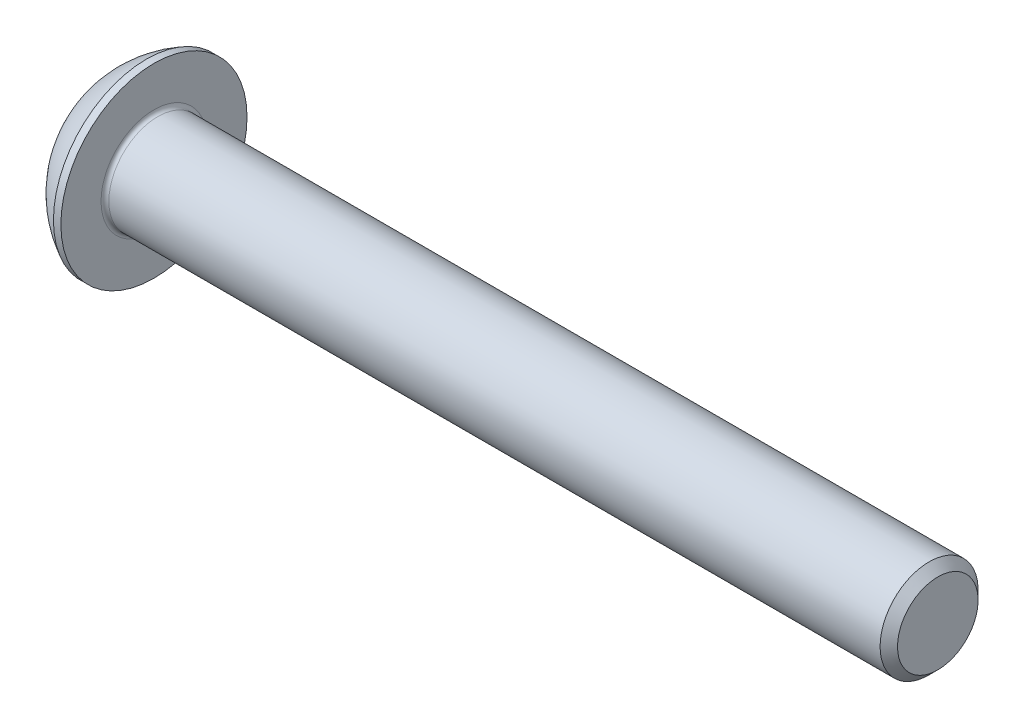
ISO-10303-21;
HEADER;
FILE_DESCRIPTION(('STEP AP214'),'2;1');
FILE_NAME('part.step','',(''),(''),'','','');
FILE_SCHEMA(('AUTOMOTIVE_DESIGN { 1 0 10303 214 1 1 1 1 }'));
ENDSEC;
DATA;
#1=APPLICATION_CONTEXT('core data for automotive mechanical design processes');
#2=APPLICATION_PROTOCOL_DEFINITION('international standard','automotive_design',2000,#1);
#3=PRODUCT_CONTEXT('',#1,'mechanical');
#4=PRODUCT('Part','Part','',(#3));
#5=PRODUCT_RELATED_PRODUCT_CATEGORY('part','',(#4));
#6=PRODUCT_DEFINITION_FORMATION('','',#4);
#7=PRODUCT_DEFINITION_CONTEXT('part definition',#1,'design');
#8=PRODUCT_DEFINITION('design','',#6,#7);
#9=PRODUCT_DEFINITION_SHAPE('','',#8);
#10=(LENGTH_UNIT() NAMED_UNIT(*) SI_UNIT(.MILLI.,.METRE.));
#11=(NAMED_UNIT(*) PLANE_ANGLE_UNIT() SI_UNIT($,.RADIAN.));
#12=(NAMED_UNIT(*) SI_UNIT($,.STERADIAN.) SOLID_ANGLE_UNIT());
#13=UNCERTAINTY_MEASURE_WITH_UNIT(LENGTH_MEASURE(1.E-05),#10,'distance_accuracy_value','');
#14=(GEOMETRIC_REPRESENTATION_CONTEXT(3) GLOBAL_UNCERTAINTY_ASSIGNED_CONTEXT((#13)) GLOBAL_UNIT_ASSIGNED_CONTEXT((#10,
#11,#12)) REPRESENTATION_CONTEXT('',''));
#15=CARTESIAN_POINT('',(0.,0.,0.));
#16=DIRECTION('',(0.,0.,1.));
#17=DIRECTION('',(1.,0.,0.));
#18=AXIS2_PLACEMENT_3D('',#15,#16,#17);
#19=CARTESIAN_POINT('',(0.,0.,0.));
#20=DIRECTION('',(-1.,0.,0.));
#21=DIRECTION('',(0.,0.,1.));
#22=AXIS2_PLACEMENT_3D('',#19,#20,#21);
#23=PLANE('',#22);
#24=CARTESIAN_POINT('',(0.,0.,0.));
#25=DIRECTION('',(-1.,0.,0.));
#26=DIRECTION('',(0.,0.,1.));
#27=AXIS2_PLACEMENT_3D('',#24,#25,#26);
#28=CIRCLE('',#27,2.375);
#29=CARTESIAN_POINT('',(0.,0.,2.375));
#30=VERTEX_POINT('',#29);
#31=EDGE_CURVE('E163',#30,#30,#28,.T.);
#32=ORIENTED_EDGE('',*,*,#31,.T.);
#33=EDGE_LOOP('',(#32));
#34=FACE_BOUND('',#33,.T.);
#35=DIRECTION('',(0.,-1.,0.));
#36=VECTOR('',#35,1.);
#37=CARTESIAN_POINT('',(0.,-0.866025403784438,1.5));
#38=LINE('',#37,#36);
#39=CARTESIAN_POINT('',(0.,0.866025403784439,1.5));
#40=VERTEX_POINT('',#39);
#41=CARTESIAN_POINT('',(0.,-0.866025403784438,1.5));
#42=VERTEX_POINT('',#41);
#43=EDGE_CURVE('E53',#40,#42,#38,.T.);
#44=ORIENTED_EDGE('',*,*,#43,.T.);
#45=DIRECTION('',(0.,-0.5,-0.866025403784439));
#46=VECTOR('',#45,1.);
#47=CARTESIAN_POINT('',(0.,-1.73205080756888,0.));
#48=LINE('',#47,#46);
#49=CARTESIAN_POINT('',(0.,-1.73205080756888,0.));
#50=VERTEX_POINT('',#49);
#51=EDGE_CURVE('E256',#42,#50,#48,.T.);
#52=ORIENTED_EDGE('',*,*,#51,.T.);
#53=DIRECTION('',(0.,0.5,-0.866025403784439));
#54=VECTOR('',#53,1.);
#55=CARTESIAN_POINT('',(0.,-0.866025403784438,-1.5));
#56=LINE('',#55,#54);
#57=CARTESIAN_POINT('',(0.,-0.866025403784438,-1.5));
#58=VERTEX_POINT('',#57);
#59=EDGE_CURVE('E138',#50,#58,#56,.T.);
#60=ORIENTED_EDGE('',*,*,#59,.T.);
#61=DIRECTION('',(0.,1.,0.));
#62=VECTOR('',#61,1.);
#63=CARTESIAN_POINT('',(0.,0.866025403784439,-1.5));
#64=LINE('',#63,#62);
#65=CARTESIAN_POINT('',(0.,0.866025403784439,-1.5));
#66=VERTEX_POINT('',#65);
#67=EDGE_CURVE('E259',#58,#66,#64,.T.);
#68=ORIENTED_EDGE('',*,*,#67,.T.);
#69=DIRECTION('',(0.,0.5,0.866025403784439));
#70=VECTOR('',#69,1.);
#71=CARTESIAN_POINT('',(0.,1.73205080756888,0.));
#72=LINE('',#71,#70);
#73=CARTESIAN_POINT('',(0.,1.73205080756888,0.));
#74=VERTEX_POINT('',#73);
#75=EDGE_CURVE('E261',#66,#74,#72,.T.);
#76=ORIENTED_EDGE('',*,*,#75,.T.);
#77=DIRECTION('',(0.,-0.5,0.866025403784439));
#78=VECTOR('',#77,1.);
#79=CARTESIAN_POINT('',(0.,0.866025403784439,1.5));
#80=LINE('',#79,#78);
#81=EDGE_CURVE('E263',#74,#40,#80,.T.);
#82=ORIENTED_EDGE('',*,*,#81,.T.);
#83=EDGE_LOOP('',(#44,#52,#60,#68,#76,#82));
#84=FACE_BOUND('',#83,.T.);
#85=ADVANCED_FACE('F38',(#34,#84),#23,.T.);
#86=CARTESIAN_POINT('',(4.75501582278481,0.,0.));
#87=DIRECTION('',(-1.,0.,0.));
#88=DIRECTION('',(0.,1.,0.));
#89=AXIS2_PLACEMENT_3D('',#86,#87,#88);
#90=SPHERICAL_SURFACE('',#89,5.3151482081814);
#91=CARTESIAN_POINT('',(2.37,0.,0.));
#92=DIRECTION('',(-1.,0.,0.));
#93=DIRECTION('',(0.,0.,1.));
#94=AXIS2_PLACEMENT_3D('',#91,#92,#93);
#95=CIRCLE('',#94,4.75);
#96=CARTESIAN_POINT('',(2.37,0.,4.75));
#97=VERTEX_POINT('',#96);
#98=EDGE_CURVE('E160',#97,#97,#95,.T.);
#99=ORIENTED_EDGE('',*,*,#98,.T.);
#100=EDGE_LOOP('',(#99));
#101=FACE_BOUND('',#100,.T.);
#102=ORIENTED_EDGE('',*,*,#31,.F.);
#103=EDGE_LOOP('',(#102));
#104=FACE_BOUND('',#103,.T.);
#105=ADVANCED_FACE('F184',(#101,#104),#90,.T.);
#106=CARTESIAN_POINT('',(0.,0.,0.));
#107=DIRECTION('',(-1.,0.,0.));
#108=DIRECTION('',(0.,0.,1.));
#109=AXIS2_PLACEMENT_3D('',#106,#107,#108);
#110=CYLINDRICAL_SURFACE('',#109,4.75);
#111=ORIENTED_EDGE('',*,*,#98,.F.);
#112=EDGE_LOOP('',(#111));
#113=FACE_BOUND('',#112,.T.);
#114=CARTESIAN_POINT('',(2.75,0.,0.));
#115=DIRECTION('',(-1.,0.,0.));
#116=DIRECTION('',(0.,0.,1.));
#117=AXIS2_PLACEMENT_3D('',#114,#115,#116);
#118=CIRCLE('',#117,4.75);
#119=CARTESIAN_POINT('',(2.75,0.,4.75));
#120=VERTEX_POINT('',#119);
#121=EDGE_CURVE('E157',#120,#120,#118,.T.);
#122=ORIENTED_EDGE('',*,*,#121,.T.);
#123=EDGE_LOOP('',(#122));
#124=FACE_BOUND('',#123,.T.);
#125=ADVANCED_FACE('F189',(#113,#124),#110,.T.);
#126=CARTESIAN_POINT('',(2.75,2.5,0.));
#127=DIRECTION('',(-1.,0.,0.));
#128=DIRECTION('',(0.,0.,1.));
#129=AXIS2_PLACEMENT_3D('',#126,#127,#128);
#130=PLANE('',#129);
#131=CARTESIAN_POINT('',(2.75,0.,0.));
#132=DIRECTION('',(-1.,0.,0.));
#133=DIRECTION('',(0.,0.,1.));
#134=AXIS2_PLACEMENT_3D('',#131,#132,#133);
#135=CIRCLE('',#134,2.7);
#136=CARTESIAN_POINT('',(2.75,0.,2.7));
#137=VERTEX_POINT('',#136);
#138=EDGE_CURVE('E46',#137,#137,#135,.T.);
#139=ORIENTED_EDGE('',*,*,#138,.T.);
#140=EDGE_LOOP('',(#139));
#141=FACE_BOUND('',#140,.T.);
#142=ORIENTED_EDGE('',*,*,#121,.F.);
#143=EDGE_LOOP('',(#142));
#144=FACE_BOUND('',#143,.T.);
#145=ADVANCED_FACE('F168',(#141,#144),#130,.F.);
#146=CARTESIAN_POINT('',(0.,0.,0.));
#147=DIRECTION('',(-1.,0.,0.));
#148=DIRECTION('',(0.,0.,1.));
#149=AXIS2_PLACEMENT_3D('',#146,#147,#148);
#150=CYLINDRICAL_SURFACE('',#149,2.5);
#151=CARTESIAN_POINT('',(2.95,0.,0.));
#152=DIRECTION('',(-1.,0.,0.));
#153=DIRECTION('',(0.,0.,1.));
#154=AXIS2_PLACEMENT_3D('',#151,#152,#153);
#155=CIRCLE('',#154,2.5);
#156=CARTESIAN_POINT('',(2.95,0.,2.5));
#157=VERTEX_POINT('',#156);
#158=EDGE_CURVE('E11',#157,#157,#155,.F.);
#159=ORIENTED_EDGE('',*,*,#158,.T.);
#160=EDGE_LOOP('',(#159));
#161=FACE_BOUND('',#160,.T.);
#162=CARTESIAN_POINT('',(42.305,0.,0.));
#163=DIRECTION('',(-1.,0.,0.));
#164=DIRECTION('',(0.,0.,1.));
#165=AXIS2_PLACEMENT_3D('',#162,#163,#164);
#166=CIRCLE('',#165,2.5);
#167=CARTESIAN_POINT('',(42.305,0.,2.5));
#168=VERTEX_POINT('',#167);
#169=EDGE_CURVE('E154',#168,#168,#166,.T.);
#170=ORIENTED_EDGE('',*,*,#169,.T.);
#171=EDGE_LOOP('',(#170));
#172=FACE_BOUND('',#171,.T.);
#173=ADVANCED_FACE('F198',(#161,#172),#150,.T.);
#174=CARTESIAN_POINT('',(42.75,0.,0.));
#175=DIRECTION('',(-1.,0.,0.));
#176=DIRECTION('',(0.,0.,1.));
#177=AXIS2_PLACEMENT_3D('',#174,#175,#176);
#178=CONICAL_SURFACE('',#177,2.055,0.785398163397426);
#179=ORIENTED_EDGE('',*,*,#169,.F.);
#180=EDGE_LOOP('',(#179));
#181=FACE_BOUND('',#180,.T.);
#182=CARTESIAN_POINT('',(42.75,0.,0.));
#183=DIRECTION('',(-1.,0.,0.));
#184=DIRECTION('',(0.,0.,1.));
#185=AXIS2_PLACEMENT_3D('',#182,#183,#184);
#186=CIRCLE('',#185,2.055);
#187=CARTESIAN_POINT('',(42.75,0.,2.055));
#188=VERTEX_POINT('',#187);
#189=EDGE_CURVE('E150',#188,#188,#186,.T.);
#190=ORIENTED_EDGE('',*,*,#189,.T.);
#191=EDGE_LOOP('',(#190));
#192=FACE_BOUND('',#191,.T.);
#193=ADVANCED_FACE('F179',(#181,#192),#178,.T.);
#194=CARTESIAN_POINT('',(42.75,0.,0.));
#195=DIRECTION('',(-1.,0.,0.));
#196=DIRECTION('',(0.,0.,1.));
#197=AXIS2_PLACEMENT_3D('',#194,#195,#196);
#198=PLANE('',#197);
#199=ORIENTED_EDGE('',*,*,#189,.F.);
#200=EDGE_LOOP('',(#199));
#201=FACE_BOUND('',#200,.T.);
#202=ADVANCED_FACE('F172',(#201),#198,.F.);
#203=CARTESIAN_POINT('',(2.95,0.,0.));
#204=DIRECTION('',(-1.,0.,0.));
#205=DIRECTION('',(0.,0.,1.));
#206=AXIS2_PLACEMENT_3D('',#203,#204,#205);
#207=TOROIDAL_SURFACE('',#206,2.7,0.2);
#208=ORIENTED_EDGE('',*,*,#158,.F.);
#209=EDGE_LOOP('',(#208));
#210=FACE_BOUND('',#209,.T.);
#211=ORIENTED_EDGE('',*,*,#138,.F.);
#212=EDGE_LOOP('',(#211));
#213=FACE_BOUND('',#212,.T.);
#214=ADVANCED_FACE('F40',(#210,#213),#207,.F.);
#215=CARTESIAN_POINT('',(1.56,-1.73205080756888,0.));
#216=DIRECTION('',(0.,0.866025403784439,-0.5));
#217=DIRECTION('',(0.,0.5,0.866025403784439));
#218=AXIS2_PLACEMENT_3D('',#215,#216,#217);
#219=PLANE('',#218);
#220=DIRECTION('',(0.,-0.5,-0.866025403784439));
#221=VECTOR('',#220,1.);
#222=CARTESIAN_POINT('',(1.56,-1.73205080756888,0.));
#223=LINE('',#222,#221);
#224=CARTESIAN_POINT('',(1.56,-0.866025403784438,1.5));
#225=VERTEX_POINT('',#224);
#226=CARTESIAN_POINT('',(1.56,-1.29903810567666,0.749999999999999));
#227=VERTEX_POINT('',#226);
#228=EDGE_CURVE('E121',#225,#227,#223,.T.);
#229=ORIENTED_EDGE('',*,*,#228,.T.);
#230=CARTESIAN_POINT('',(1.56,-1.73205080756888,0.));
#231=VERTEX_POINT('',#230);
#232=EDGE_CURVE('E114',#227,#231,#223,.T.);
#233=ORIENTED_EDGE('',*,*,#232,.T.);
#234=DIRECTION('',(-1.,0.,0.));
#235=VECTOR('',#234,1.);
#236=CARTESIAN_POINT('',(1.56,-1.73205080756888,0.));
#237=LINE('',#236,#235);
#238=EDGE_CURVE('E118',#231,#50,#237,.T.);
#239=ORIENTED_EDGE('',*,*,#238,.T.);
#240=ORIENTED_EDGE('',*,*,#51,.F.);
#241=DIRECTION('',(-1.,0.,0.));
#242=VECTOR('',#241,1.);
#243=CARTESIAN_POINT('',(1.56,-0.866025403784438,1.5));
#244=LINE('',#243,#242);
#245=EDGE_CURVE('E246',#225,#42,#244,.T.);
#246=ORIENTED_EDGE('',*,*,#245,.F.);
#247=EDGE_LOOP('',(#229,#233,#239,#240,#246));
#248=FACE_BOUND('',#247,.T.);
#249=ADVANCED_FACE('F116',(#248),#219,.T.);
#250=CARTESIAN_POINT('',(1.56,-0.866025403784438,-1.5));
#251=DIRECTION('',(0.,0.866025403784439,0.5));
#252=DIRECTION('',(0.,-0.5,0.866025403784439));
#253=AXIS2_PLACEMENT_3D('',#250,#251,#252);
#254=PLANE('',#253);
#255=DIRECTION('',(0.,0.5,-0.866025403784439));
#256=VECTOR('',#255,1.);
#257=CARTESIAN_POINT('',(1.56,-0.866025403784438,-1.5));
#258=LINE('',#257,#256);
#259=CARTESIAN_POINT('',(1.56,-1.29903810567666,-0.749999999999999));
#260=VERTEX_POINT('',#259);
#261=EDGE_CURVE('E126',#231,#260,#258,.T.);
#262=ORIENTED_EDGE('',*,*,#261,.T.);
#263=CARTESIAN_POINT('',(1.56,-0.866025403784438,-1.5));
#264=VERTEX_POINT('',#263);
#265=EDGE_CURVE('E133',#260,#264,#258,.T.);
#266=ORIENTED_EDGE('',*,*,#265,.T.);
#267=DIRECTION('',(-1.,0.,0.));
#268=VECTOR('',#267,1.);
#269=CARTESIAN_POINT('',(1.56,-0.866025403784438,-1.5));
#270=LINE('',#269,#268);
#271=EDGE_CURVE('E140',#264,#58,#270,.T.);
#272=ORIENTED_EDGE('',*,*,#271,.T.);
#273=ORIENTED_EDGE('',*,*,#59,.F.);
#274=ORIENTED_EDGE('',*,*,#238,.F.);
#275=EDGE_LOOP('',(#262,#266,#272,#273,#274));
#276=FACE_BOUND('',#275,.T.);
#277=ADVANCED_FACE('F136',(#276),#254,.T.);
#278=CARTESIAN_POINT('',(1.56,0.866025403784439,-1.5));
#279=DIRECTION('',(0.,0.,1.));
#280=DIRECTION('',(1.,0.,0.));
#281=AXIS2_PLACEMENT_3D('',#278,#279,#280);
#282=PLANE('',#281);
#283=DIRECTION('',(0.,1.,0.));
#284=VECTOR('',#283,1.);
#285=CARTESIAN_POINT('',(1.56,0.866025403784439,-1.5));
#286=LINE('',#285,#284);
#287=CARTESIAN_POINT('',(1.56,0.,-1.5));
#288=VERTEX_POINT('',#287);
#289=EDGE_CURVE('E282',#264,#288,#286,.T.);
#290=ORIENTED_EDGE('',*,*,#289,.T.);
#291=CARTESIAN_POINT('',(1.56,0.866025403784439,-1.5));
#292=VERTEX_POINT('',#291);
#293=EDGE_CURVE('E132',#288,#292,#286,.T.);
#294=ORIENTED_EDGE('',*,*,#293,.T.);
#295=DIRECTION('',(-1.,0.,0.));
#296=VECTOR('',#295,1.);
#297=CARTESIAN_POINT('',(1.56,0.866025403784439,-1.5));
#298=LINE('',#297,#296);
#299=EDGE_CURVE('E145',#292,#66,#298,.T.);
#300=ORIENTED_EDGE('',*,*,#299,.T.);
#301=ORIENTED_EDGE('',*,*,#67,.F.);
#302=ORIENTED_EDGE('',*,*,#271,.F.);
#303=EDGE_LOOP('',(#290,#294,#300,#301,#302));
#304=FACE_BOUND('',#303,.T.);
#305=ADVANCED_FACE('F212',(#304),#282,.T.);
#306=CARTESIAN_POINT('',(1.56,1.73205080756888,0.));
#307=DIRECTION('',(0.,-0.866025403784438,0.5));
#308=DIRECTION('',(0.,-0.5,-0.866025403784439));
#309=AXIS2_PLACEMENT_3D('',#306,#307,#308);
#310=PLANE('',#309);
#311=DIRECTION('',(0.,0.5,0.866025403784439));
#312=VECTOR('',#311,1.);
#313=CARTESIAN_POINT('',(1.56,1.73205080756888,0.));
#314=LINE('',#313,#312);
#315=CARTESIAN_POINT('',(1.56,1.29903810567666,-0.750000000000001));
#316=VERTEX_POINT('',#315);
#317=EDGE_CURVE('E288',#292,#316,#314,.T.);
#318=ORIENTED_EDGE('',*,*,#317,.T.);
#319=CARTESIAN_POINT('',(1.56,1.73205080756888,0.));
#320=VERTEX_POINT('',#319);
#321=EDGE_CURVE('E286',#316,#320,#314,.T.);
#322=ORIENTED_EDGE('',*,*,#321,.T.);
#323=DIRECTION('',(-1.,0.,0.));
#324=VECTOR('',#323,1.);
#325=CARTESIAN_POINT('',(1.56,1.73205080756888,0.));
#326=LINE('',#325,#324);
#327=EDGE_CURVE('E268',#320,#74,#326,.T.);
#328=ORIENTED_EDGE('',*,*,#327,.T.);
#329=ORIENTED_EDGE('',*,*,#75,.F.);
#330=ORIENTED_EDGE('',*,*,#299,.F.);
#331=EDGE_LOOP('',(#318,#322,#328,#329,#330));
#332=FACE_BOUND('',#331,.T.);
#333=ADVANCED_FACE('F215',(#332),#310,.T.);
#334=CARTESIAN_POINT('',(1.56,0.866025403784439,1.5));
#335=DIRECTION('',(0.,-0.866025403784439,-0.5));
#336=DIRECTION('',(0.,0.5,-0.866025403784439));
#337=AXIS2_PLACEMENT_3D('',#334,#335,#336);
#338=PLANE('',#337);
#339=DIRECTION('',(0.,-0.5,0.866025403784439));
#340=VECTOR('',#339,1.);
#341=CARTESIAN_POINT('',(1.56,0.866025403784439,1.5));
#342=LINE('',#341,#340);
#343=CARTESIAN_POINT('',(1.56,1.29903810567666,0.75));
#344=VERTEX_POINT('',#343);
#345=EDGE_CURVE('E252',#320,#344,#342,.T.);
#346=ORIENTED_EDGE('',*,*,#345,.T.);
#347=CARTESIAN_POINT('',(1.56,0.866025403784439,1.5));
#348=VERTEX_POINT('',#347);
#349=EDGE_CURVE('E244',#344,#348,#342,.T.);
#350=ORIENTED_EDGE('',*,*,#349,.T.);
#351=DIRECTION('',(-1.,0.,0.));
#352=VECTOR('',#351,1.);
#353=CARTESIAN_POINT('',(1.56,0.866025403784439,1.5));
#354=LINE('',#353,#352);
#355=EDGE_CURVE('E250',#348,#40,#354,.T.);
#356=ORIENTED_EDGE('',*,*,#355,.T.);
#357=ORIENTED_EDGE('',*,*,#81,.F.);
#358=ORIENTED_EDGE('',*,*,#327,.F.);
#359=EDGE_LOOP('',(#346,#350,#356,#357,#358));
#360=FACE_BOUND('',#359,.T.);
#361=ADVANCED_FACE('F219',(#360),#338,.T.);
#362=CARTESIAN_POINT('',(1.56,-0.866025403784438,1.5));
#363=DIRECTION('',(0.,0.,-1.));
#364=DIRECTION('',(-1.,0.,0.));
#365=AXIS2_PLACEMENT_3D('',#362,#363,#364);
#366=PLANE('',#365);
#367=DIRECTION('',(0.,-1.,0.));
#368=VECTOR('',#367,1.);
#369=CARTESIAN_POINT('',(1.56,-0.866025403784438,1.5));
#370=LINE('',#369,#368);
#371=CARTESIAN_POINT('',(1.56,0.,1.5));
#372=VERTEX_POINT('',#371);
#373=EDGE_CURVE('E61',#348,#372,#370,.T.);
#374=ORIENTED_EDGE('',*,*,#373,.T.);
#375=EDGE_CURVE('E247',#372,#225,#370,.T.);
#376=ORIENTED_EDGE('',*,*,#375,.T.);
#377=ORIENTED_EDGE('',*,*,#245,.T.);
#378=ORIENTED_EDGE('',*,*,#43,.F.);
#379=ORIENTED_EDGE('',*,*,#355,.F.);
#380=EDGE_LOOP('',(#374,#376,#377,#378,#379));
#381=FACE_BOUND('',#380,.T.);
#382=ADVANCED_FACE('F223',(#381),#366,.T.);
#383=CARTESIAN_POINT('',(1.56,-0.866025403784438,1.5));
#384=DIRECTION('',(-1.,0.,0.));
#385=DIRECTION('',(0.,0.,1.));
#386=AXIS2_PLACEMENT_3D('',#383,#384,#385);
#387=PLANE('',#386);
#388=ORIENTED_EDGE('',*,*,#373,.F.);
#389=ORIENTED_EDGE('',*,*,#349,.F.);
#390=CARTESIAN_POINT('',(1.56,0.,0.));
#391=DIRECTION('',(-1.,0.,0.));
#392=DIRECTION('',(0.,0.,1.));
#393=AXIS2_PLACEMENT_3D('',#390,#391,#392);
#394=CIRCLE('',#393,1.5);
#395=EDGE_CURVE('E144',#372,#344,#394,.T.);
#396=ORIENTED_EDGE('',*,*,#395,.F.);
#397=EDGE_LOOP('',(#388,#389,#396));
#398=FACE_BOUND('',#397,.T.);
#399=ADVANCED_FACE('F227',(#398),#387,.T.);
#400=ORIENTED_EDGE('',*,*,#345,.F.);
#401=ORIENTED_EDGE('',*,*,#321,.F.);
#402=EDGE_CURVE('E151',#344,#316,#394,.T.);
#403=ORIENTED_EDGE('',*,*,#402,.F.);
#404=EDGE_LOOP('',(#400,#401,#403));
#405=FACE_BOUND('',#404,.T.);
#406=ADVANCED_FACE('F235',(#405),#387,.T.);
#407=ORIENTED_EDGE('',*,*,#317,.F.);
#408=ORIENTED_EDGE('',*,*,#293,.F.);
#409=EDGE_CURVE('E293',#316,#288,#394,.T.);
#410=ORIENTED_EDGE('',*,*,#409,.F.);
#411=EDGE_LOOP('',(#407,#408,#410));
#412=FACE_BOUND('',#411,.T.);
#413=ADVANCED_FACE('F240',(#412),#387,.T.);
#414=ORIENTED_EDGE('',*,*,#289,.F.);
#415=ORIENTED_EDGE('',*,*,#265,.F.);
#416=EDGE_CURVE('E285',#288,#260,#394,.T.);
#417=ORIENTED_EDGE('',*,*,#416,.F.);
#418=EDGE_LOOP('',(#414,#415,#417));
#419=FACE_BOUND('',#418,.T.);
#420=ADVANCED_FACE('F233',(#419),#387,.T.);
#421=ORIENTED_EDGE('',*,*,#261,.F.);
#422=ORIENTED_EDGE('',*,*,#232,.F.);
#423=EDGE_CURVE('E128',#260,#227,#394,.T.);
#424=ORIENTED_EDGE('',*,*,#423,.F.);
#425=EDGE_LOOP('',(#421,#422,#424));
#426=FACE_BOUND('',#425,.T.);
#427=ADVANCED_FACE('F127',(#426),#387,.T.);
#428=ORIENTED_EDGE('',*,*,#228,.F.);
#429=ORIENTED_EDGE('',*,*,#375,.F.);
#430=EDGE_CURVE('E139',#227,#372,#394,.T.);
#431=ORIENTED_EDGE('',*,*,#430,.F.);
#432=EDGE_LOOP('',(#428,#429,#431));
#433=FACE_BOUND('',#432,.T.);
#434=ADVANCED_FACE('F207',(#433),#387,.T.);
#435=CARTESIAN_POINT('',(2.42602540378445,0.,0.));
#436=DIRECTION('',(-1.,0.,0.));
#437=DIRECTION('',(0.,0.,1.));
#438=AXIS2_PLACEMENT_3D('',#435,#436,#437);
#439=CONICAL_SURFACE('',#438,0.,1.04719755119659);
#440=ORIENTED_EDGE('',*,*,#395,.T.);
#441=ORIENTED_EDGE('',*,*,#402,.T.);
#442=ORIENTED_EDGE('',*,*,#409,.T.);
#443=ORIENTED_EDGE('',*,*,#416,.T.);
#444=ORIENTED_EDGE('',*,*,#423,.T.);
#445=ORIENTED_EDGE('',*,*,#430,.T.);
#446=EDGE_LOOP('',(#440,#441,#442,#443,#444,#445));
#447=FACE_BOUND('',#446,.T.);
#448=CARTESIAN_POINT('',(2.42602540378445,0.,0.));
#449=VERTEX_POINT('',#448);
#450=VERTEX_LOOP('',#449);
#451=FACE_BOUND('',#450,.T.);
#452=ADVANCED_FACE('F205',(#447,#451),#439,.F.);
#453=CLOSED_SHELL('',(#85,#105,#125,#145,#173,#193,#202,#214,#249,#277,#305,#333,#361,#382,#399,
#406,#413,#420,#427,#434,#452));
#454=MANIFOLD_SOLID_BREP('B2',#453);
#455=ADVANCED_BREP_SHAPE_REPRESENTATION('',(#18,#454),#14);
#456=SHAPE_DEFINITION_REPRESENTATION(#9,#455);
ENDSEC;
END-ISO-10303-21;
